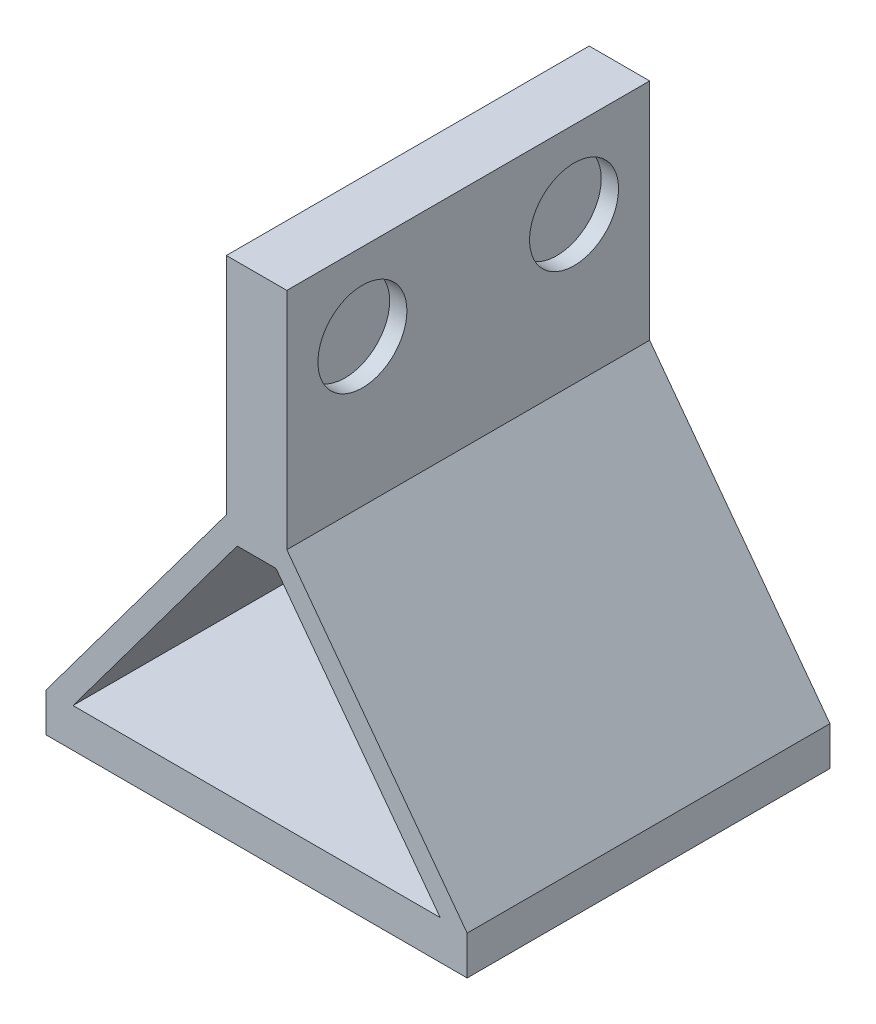
ISO-10303-21;
HEADER;
FILE_DESCRIPTION(('STEP AP214'),'2;1');
FILE_NAME('part.step','',(''),(''),'','','');
FILE_SCHEMA(('AUTOMOTIVE_DESIGN { 1 0 10303 214 1 1 1 1 }'));
ENDSEC;
DATA;
#1=APPLICATION_CONTEXT('core data for automotive mechanical design processes');
#2=APPLICATION_PROTOCOL_DEFINITION('international standard','automotive_design',2000,#1);
#3=PRODUCT_CONTEXT('',#1,'mechanical');
#4=PRODUCT('Part','Part','',(#3));
#5=PRODUCT_RELATED_PRODUCT_CATEGORY('part','',(#4));
#6=PRODUCT_DEFINITION_FORMATION('','',#4);
#7=PRODUCT_DEFINITION_CONTEXT('part definition',#1,'design');
#8=PRODUCT_DEFINITION('design','',#6,#7);
#9=PRODUCT_DEFINITION_SHAPE('','',#8);
#10=(LENGTH_UNIT() NAMED_UNIT(*) SI_UNIT(.MILLI.,.METRE.));
#11=(NAMED_UNIT(*) PLANE_ANGLE_UNIT() SI_UNIT($,.RADIAN.));
#12=(NAMED_UNIT(*) SI_UNIT($,.STERADIAN.) SOLID_ANGLE_UNIT());
#13=UNCERTAINTY_MEASURE_WITH_UNIT(LENGTH_MEASURE(1.E-05),#10,'distance_accuracy_value','');
#14=(GEOMETRIC_REPRESENTATION_CONTEXT(3) GLOBAL_UNCERTAINTY_ASSIGNED_CONTEXT((#13)) GLOBAL_UNIT_ASSIGNED_CONTEXT((#10,
#11,#12)) REPRESENTATION_CONTEXT('',''));
#15=CARTESIAN_POINT('',(0.,0.,0.));
#16=DIRECTION('',(0.,0.,1.));
#17=DIRECTION('',(1.,0.,0.));
#18=AXIS2_PLACEMENT_3D('',#15,#16,#17);
#19=CARTESIAN_POINT('',(0.,0.,42.));
#20=DIRECTION('',(0.,0.,1.));
#21=DIRECTION('',(1.,0.,0.));
#22=AXIS2_PLACEMENT_3D('',#19,#20,#21);
#23=PLANE('',#22);
#24=DIRECTION('',(-0.597706927132629,-0.801714680704844,0.));
#25=VECTOR('',#24,1.);
#26=CARTESIAN_POINT('',(-4.04711838006231,25.5155763239875,42.));
#27=LINE('',#26,#25);
#28=CARTESIAN_POINT('',(-4.04711838006231,25.5155763239875,42.));
#29=VERTEX_POINT('',#28);
#30=CARTESIAN_POINT('',(-24.9221183800623,-2.48442367601246,42.));
#31=VERTEX_POINT('',#30);
#32=EDGE_CURVE('E283',#29,#31,#27,.T.);
#33=ORIENTED_EDGE('',*,*,#32,.T.);
#34=DIRECTION('',(0.,-1.,0.));
#35=VECTOR('',#34,1.);
#36=CARTESIAN_POINT('',(-24.9221183800623,-2.48442367601246,42.));
#37=LINE('',#36,#35);
#38=CARTESIAN_POINT('',(-24.9221183800623,-6.98442367601246,42.));
#39=VERTEX_POINT('',#38);
#40=EDGE_CURVE('E287',#31,#39,#37,.T.);
#41=ORIENTED_EDGE('',*,*,#40,.T.);
#42=DIRECTION('',(1.,0.,0.));
#43=VECTOR('',#42,1.);
#44=CARTESIAN_POINT('',(-24.9221183800623,-6.98442367601246,42.));
#45=LINE('',#44,#43);
#46=CARTESIAN_POINT('',(23.8278816199377,-6.98442367601246,42.));
#47=VERTEX_POINT('',#46);
#48=EDGE_CURVE('E157',#39,#47,#45,.T.);
#49=ORIENTED_EDGE('',*,*,#48,.T.);
#50=DIRECTION('',(0.,1.,0.));
#51=VECTOR('',#50,1.);
#52=CARTESIAN_POINT('',(23.8278816199377,-2.48442367601246,42.));
#53=LINE('',#52,#51);
#54=CARTESIAN_POINT('',(23.8278816199377,-2.48442367601246,42.));
#55=VERTEX_POINT('',#54);
#56=EDGE_CURVE('E291',#47,#55,#53,.T.);
#57=ORIENTED_EDGE('',*,*,#56,.T.);
#58=DIRECTION('',(-0.597706927132629,0.801714680704844,0.));
#59=VECTOR('',#58,1.);
#60=CARTESIAN_POINT('',(2.95288161993769,25.5155763239875,42.));
#61=LINE('',#60,#59);
#62=CARTESIAN_POINT('',(2.95288161993769,25.5155763239875,42.));
#63=VERTEX_POINT('',#62);
#64=EDGE_CURVE('E294',#55,#63,#61,.T.);
#65=ORIENTED_EDGE('',*,*,#64,.T.);
#66=DIRECTION('',(0.,1.,0.));
#67=VECTOR('',#66,1.);
#68=CARTESIAN_POINT('',(2.95288161993769,25.5155763239875,42.));
#69=LINE('',#68,#67);
#70=CARTESIAN_POINT('',(2.95288161993769,51.5155763239875,42.));
#71=VERTEX_POINT('',#70);
#72=EDGE_CURVE('E234',#63,#71,#69,.T.);
#73=ORIENTED_EDGE('',*,*,#72,.T.);
#74=DIRECTION('',(-1.,0.,0.));
#75=VECTOR('',#74,1.);
#76=CARTESIAN_POINT('',(-4.04711838006231,51.5155763239875,42.));
#77=LINE('',#76,#75);
#78=CARTESIAN_POINT('',(-4.04711838006231,51.5155763239875,42.));
#79=VERTEX_POINT('',#78);
#80=EDGE_CURVE('E222',#71,#79,#77,.T.);
#81=ORIENTED_EDGE('',*,*,#80,.T.);
#82=DIRECTION('',(0.,-1.,0.));
#83=VECTOR('',#82,1.);
#84=CARTESIAN_POINT('',(-4.04711838006231,25.5155763239875,42.));
#85=LINE('',#84,#83);
#86=EDGE_CURVE('E205',#79,#29,#85,.T.);
#87=ORIENTED_EDGE('',*,*,#86,.T.);
#88=EDGE_LOOP('',(#33,#41,#49,#57,#65,#73,#81,#87));
#89=FACE_BOUND('',#88,.T.);
#90=DIRECTION('',(-0.597706927132629,0.801714680704844,0.));
#91=VECTOR('',#90,1.);
#92=CARTESIAN_POINT('',(1.6984045517565,23.0155763239875,42.));
#93=LINE('',#92,#91);
#94=CARTESIAN_POINT('',(20.7095652660422,-2.48442367601246,42.));
#95=VERTEX_POINT('',#94);
#96=CARTESIAN_POINT('',(1.6984045517565,23.0155763239875,42.));
#97=VERTEX_POINT('',#96);
#98=EDGE_CURVE('E249',#95,#97,#93,.T.);
#99=ORIENTED_EDGE('',*,*,#98,.F.);
#100=DIRECTION('',(1.,0.,0.));
#101=VECTOR('',#100,1.);
#102=CARTESIAN_POINT('',(-21.8038020261668,-2.48442367601246,42.));
#103=LINE('',#102,#101);
#104=CARTESIAN_POINT('',(-21.8038020261668,-2.48442367601246,42.));
#105=VERTEX_POINT('',#104);
#106=EDGE_CURVE('E246',#105,#95,#103,.T.);
#107=ORIENTED_EDGE('',*,*,#106,.F.);
#108=DIRECTION('',(-0.597706927132629,-0.801714680704844,0.));
#109=VECTOR('',#108,1.);
#110=CARTESIAN_POINT('',(-21.8038020261668,-2.48442367601246,42.));
#111=LINE('',#110,#109);
#112=CARTESIAN_POINT('',(-2.79264131188112,23.0155763239875,42.));
#113=VERTEX_POINT('',#112);
#114=EDGE_CURVE('E256',#113,#105,#111,.T.);
#115=ORIENTED_EDGE('',*,*,#114,.F.);
#116=DIRECTION('',(-1.,0.,0.));
#117=VECTOR('',#116,1.);
#118=CARTESIAN_POINT('',(-2.79264131188112,23.0155763239875,42.));
#119=LINE('',#118,#117);
#120=EDGE_CURVE('E253',#97,#113,#119,.T.);
#121=ORIENTED_EDGE('',*,*,#120,.F.);
#122=EDGE_LOOP('',(#99,#107,#115,#121));
#123=FACE_BOUND('',#122,.T.);
#124=ADVANCED_FACE('F45',(#89,#123),#23,.T.);
#125=CARTESIAN_POINT('',(0.,0.,0.));
#126=DIRECTION('',(0.,0.,1.));
#127=DIRECTION('',(1.,0.,0.));
#128=AXIS2_PLACEMENT_3D('',#125,#126,#127);
#129=PLANE('',#128);
#130=DIRECTION('',(-0.597706927132629,-0.801714680704844,0.));
#131=VECTOR('',#130,1.);
#132=CARTESIAN_POINT('',(-4.04711838006231,25.5155763239875,0.));
#133=LINE('',#132,#131);
#134=CARTESIAN_POINT('',(-4.04711838006231,25.5155763239875,0.));
#135=VERTEX_POINT('',#134);
#136=CARTESIAN_POINT('',(-24.9221183800623,-2.48442367601246,0.));
#137=VERTEX_POINT('',#136);
#138=EDGE_CURVE('E149',#135,#137,#133,.T.);
#139=ORIENTED_EDGE('',*,*,#138,.F.);
#140=DIRECTION('',(0.,-1.,0.));
#141=VECTOR('',#140,1.);
#142=CARTESIAN_POINT('',(-4.04711838006231,25.5155763239875,0.));
#143=LINE('',#142,#141);
#144=CARTESIAN_POINT('',(-4.04711838006231,51.5155763239875,0.));
#145=VERTEX_POINT('',#144);
#146=EDGE_CURVE('E217',#145,#135,#143,.T.);
#147=ORIENTED_EDGE('',*,*,#146,.F.);
#148=DIRECTION('',(-1.,0.,0.));
#149=VECTOR('',#148,1.);
#150=CARTESIAN_POINT('',(-4.04711838006231,51.5155763239875,0.));
#151=LINE('',#150,#149);
#152=CARTESIAN_POINT('',(2.95288161993769,51.5155763239875,0.));
#153=VERTEX_POINT('',#152);
#154=EDGE_CURVE('E226',#153,#145,#151,.T.);
#155=ORIENTED_EDGE('',*,*,#154,.F.);
#156=DIRECTION('',(0.,1.,0.));
#157=VECTOR('',#156,1.);
#158=CARTESIAN_POINT('',(2.95288161993769,25.5155763239875,0.));
#159=LINE('',#158,#157);
#160=CARTESIAN_POINT('',(2.95288161993769,25.5155763239875,0.));
#161=VERTEX_POINT('',#160);
#162=EDGE_CURVE('E221',#161,#153,#159,.T.);
#163=ORIENTED_EDGE('',*,*,#162,.F.);
#164=DIRECTION('',(-0.597706927132629,0.801714680704844,0.));
#165=VECTOR('',#164,1.);
#166=CARTESIAN_POINT('',(2.95288161993769,25.5155763239875,0.));
#167=LINE('',#166,#165);
#168=CARTESIAN_POINT('',(23.8278816199377,-2.48442367601246,0.));
#169=VERTEX_POINT('',#168);
#170=EDGE_CURVE('E288',#169,#161,#167,.T.);
#171=ORIENTED_EDGE('',*,*,#170,.F.);
#172=DIRECTION('',(0.,1.,0.));
#173=VECTOR('',#172,1.);
#174=CARTESIAN_POINT('',(23.8278816199377,-2.48442367601246,0.));
#175=LINE('',#174,#173);
#176=CARTESIAN_POINT('',(23.8278816199377,-6.98442367601246,0.));
#177=VERTEX_POINT('',#176);
#178=EDGE_CURVE('E148',#177,#169,#175,.T.);
#179=ORIENTED_EDGE('',*,*,#178,.F.);
#180=DIRECTION('',(1.,0.,0.));
#181=VECTOR('',#180,1.);
#182=CARTESIAN_POINT('',(-24.9221183800623,-6.98442367601246,0.));
#183=LINE('',#182,#181);
#184=CARTESIAN_POINT('',(-24.9221183800623,-6.98442367601246,0.));
#185=VERTEX_POINT('',#184);
#186=EDGE_CURVE('E155',#185,#177,#183,.T.);
#187=ORIENTED_EDGE('',*,*,#186,.F.);
#188=DIRECTION('',(0.,-1.,0.));
#189=VECTOR('',#188,1.);
#190=CARTESIAN_POINT('',(-24.9221183800623,-2.48442367601246,0.));
#191=LINE('',#190,#189);
#192=EDGE_CURVE('E137',#137,#185,#191,.T.);
#193=ORIENTED_EDGE('',*,*,#192,.F.);
#194=EDGE_LOOP('',(#139,#147,#155,#163,#171,#179,#187,#193));
#195=FACE_BOUND('',#194,.T.);
#196=DIRECTION('',(1.,0.,0.));
#197=VECTOR('',#196,1.);
#198=CARTESIAN_POINT('',(-21.8038020261668,-2.48442367601246,0.));
#199=LINE('',#198,#197);
#200=CARTESIAN_POINT('',(-21.8038020261668,-2.48442367601246,0.));
#201=VERTEX_POINT('',#200);
#202=CARTESIAN_POINT('',(20.7095652660422,-2.48442367601246,0.));
#203=VERTEX_POINT('',#202);
#204=EDGE_CURVE('E70',#201,#203,#199,.T.);
#205=ORIENTED_EDGE('',*,*,#204,.T.);
#206=DIRECTION('',(-0.597706927132629,0.801714680704844,0.));
#207=VECTOR('',#206,1.);
#208=CARTESIAN_POINT('',(1.6984045517565,23.0155763239875,0.));
#209=LINE('',#208,#207);
#210=CARTESIAN_POINT('',(1.6984045517565,23.0155763239875,0.));
#211=VERTEX_POINT('',#210);
#212=EDGE_CURVE('E262',#203,#211,#209,.T.);
#213=ORIENTED_EDGE('',*,*,#212,.T.);
#214=DIRECTION('',(-1.,0.,0.));
#215=VECTOR('',#214,1.);
#216=CARTESIAN_POINT('',(-2.79264131188112,23.0155763239875,0.));
#217=LINE('',#216,#215);
#218=CARTESIAN_POINT('',(-2.79264131188112,23.0155763239875,0.));
#219=VERTEX_POINT('',#218);
#220=EDGE_CURVE('E266',#211,#219,#217,.T.);
#221=ORIENTED_EDGE('',*,*,#220,.T.);
#222=DIRECTION('',(-0.597706927132629,-0.801714680704844,0.));
#223=VECTOR('',#222,1.);
#224=CARTESIAN_POINT('',(-21.8038020261668,-2.48442367601246,0.));
#225=LINE('',#224,#223);
#226=EDGE_CURVE('E250',#219,#201,#225,.T.);
#227=ORIENTED_EDGE('',*,*,#226,.T.);
#228=EDGE_LOOP('',(#205,#213,#221,#227));
#229=FACE_BOUND('',#228,.T.);
#230=ADVANCED_FACE('F161',(#195,#229),#129,.F.);
#231=CARTESIAN_POINT('',(-4.04711838006231,25.5155763239875,42.));
#232=DIRECTION('',(0.801714680704844,-0.597706927132629,0.));
#233=DIRECTION('',(0.597706927132629,0.801714680704844,0.));
#234=AXIS2_PLACEMENT_3D('',#231,#232,#233);
#235=PLANE('',#234);
#236=ORIENTED_EDGE('',*,*,#138,.T.);
#237=DIRECTION('',(0.,0.,-1.));
#238=VECTOR('',#237,1.);
#239=CARTESIAN_POINT('',(-24.9221183800623,-2.48442367601246,42.));
#240=LINE('',#239,#238);
#241=EDGE_CURVE('E11',#31,#137,#240,.T.);
#242=ORIENTED_EDGE('',*,*,#241,.F.);
#243=ORIENTED_EDGE('',*,*,#32,.F.);
#244=DIRECTION('',(0.,0.,-1.));
#245=VECTOR('',#244,1.);
#246=CARTESIAN_POINT('',(-4.04711838006231,25.5155763239875,42.));
#247=LINE('',#246,#245);
#248=EDGE_CURVE('E297',#29,#135,#247,.T.);
#249=ORIENTED_EDGE('',*,*,#248,.T.);
#250=EDGE_LOOP('',(#236,#242,#243,#249));
#251=FACE_BOUND('',#250,.T.);
#252=ADVANCED_FACE('F47',(#251),#235,.F.);
#253=CARTESIAN_POINT('',(-24.9221183800623,-2.48442367601246,42.));
#254=DIRECTION('',(1.,0.,0.));
#255=DIRECTION('',(0.,0.,-1.));
#256=AXIS2_PLACEMENT_3D('',#253,#254,#255);
#257=PLANE('',#256);
#258=ORIENTED_EDGE('',*,*,#192,.T.);
#259=DIRECTION('',(0.,0.,1.));
#260=VECTOR('',#259,1.);
#261=CARTESIAN_POINT('',(-24.9221183800623,-6.98442367601246,0.));
#262=LINE('',#261,#260);
#263=EDGE_CURVE('E140',#185,#39,#262,.T.);
#264=ORIENTED_EDGE('',*,*,#263,.T.);
#265=ORIENTED_EDGE('',*,*,#40,.F.);
#266=ORIENTED_EDGE('',*,*,#241,.T.);
#267=EDGE_LOOP('',(#258,#264,#265,#266));
#268=FACE_BOUND('',#267,.T.);
#269=ADVANCED_FACE('F139',(#268),#257,.F.);
#270=CARTESIAN_POINT('',(23.8278816199377,-2.48442367601246,42.));
#271=DIRECTION('',(-1.,0.,0.));
#272=DIRECTION('',(0.,0.,1.));
#273=AXIS2_PLACEMENT_3D('',#270,#271,#272);
#274=PLANE('',#273);
#275=ORIENTED_EDGE('',*,*,#178,.T.);
#276=DIRECTION('',(0.,0.,-1.));
#277=VECTOR('',#276,1.);
#278=CARTESIAN_POINT('',(23.8278816199377,-2.48442367601246,42.));
#279=LINE('',#278,#277);
#280=EDGE_CURVE('E55',#55,#169,#279,.T.);
#281=ORIENTED_EDGE('',*,*,#280,.F.);
#282=ORIENTED_EDGE('',*,*,#56,.F.);
#283=DIRECTION('',(0.,0.,1.));
#284=VECTOR('',#283,1.);
#285=CARTESIAN_POINT('',(23.8278816199377,-6.98442367601246,0.));
#286=LINE('',#285,#284);
#287=EDGE_CURVE('E159',#177,#47,#286,.T.);
#288=ORIENTED_EDGE('',*,*,#287,.F.);
#289=EDGE_LOOP('',(#275,#281,#282,#288));
#290=FACE_BOUND('',#289,.T.);
#291=ADVANCED_FACE('F340',(#290),#274,.F.);
#292=CARTESIAN_POINT('',(2.95288161993769,25.5155763239875,42.));
#293=DIRECTION('',(-0.801714680704844,-0.597706927132629,0.));
#294=DIRECTION('',(0.597706927132629,-0.801714680704844,0.));
#295=AXIS2_PLACEMENT_3D('',#292,#293,#294);
#296=PLANE('',#295);
#297=ORIENTED_EDGE('',*,*,#170,.T.);
#298=DIRECTION('',(0.,0.,-1.));
#299=VECTOR('',#298,1.);
#300=CARTESIAN_POINT('',(2.95288161993769,25.5155763239875,42.));
#301=LINE('',#300,#299);
#302=EDGE_CURVE('E306',#63,#161,#301,.T.);
#303=ORIENTED_EDGE('',*,*,#302,.F.);
#304=ORIENTED_EDGE('',*,*,#64,.F.);
#305=ORIENTED_EDGE('',*,*,#280,.T.);
#306=EDGE_LOOP('',(#297,#303,#304,#305));
#307=FACE_BOUND('',#306,.T.);
#308=ADVANCED_FACE('F315',(#307),#296,.F.);
#309=CARTESIAN_POINT('',(-21.8038020261668,-2.48442367601246,42.));
#310=DIRECTION('',(0.,1.,0.));
#311=DIRECTION('',(0.,0.,1.));
#312=AXIS2_PLACEMENT_3D('',#309,#310,#311);
#313=PLANE('',#312);
#314=ORIENTED_EDGE('',*,*,#204,.F.);
#315=DIRECTION('',(0.,0.,-1.));
#316=VECTOR('',#315,1.);
#317=CARTESIAN_POINT('',(-21.8038020261668,-2.48442367601246,42.));
#318=LINE('',#317,#316);
#319=EDGE_CURVE('E259',#105,#201,#318,.T.);
#320=ORIENTED_EDGE('',*,*,#319,.F.);
#321=ORIENTED_EDGE('',*,*,#106,.T.);
#322=DIRECTION('',(0.,0.,-1.));
#323=VECTOR('',#322,1.);
#324=CARTESIAN_POINT('',(20.7095652660422,-2.48442367601246,42.));
#325=LINE('',#324,#323);
#326=EDGE_CURVE('E280',#95,#203,#325,.T.);
#327=ORIENTED_EDGE('',*,*,#326,.T.);
#328=EDGE_LOOP('',(#314,#320,#321,#327));
#329=FACE_BOUND('',#328,.T.);
#330=ADVANCED_FACE('F349',(#329),#313,.T.);
#331=CARTESIAN_POINT('',(1.6984045517565,23.0155763239875,42.));
#332=DIRECTION('',(-0.801714680704844,-0.597706927132629,0.));
#333=DIRECTION('',(0.597706927132629,-0.801714680704844,0.));
#334=AXIS2_PLACEMENT_3D('',#331,#332,#333);
#335=PLANE('',#334);
#336=ORIENTED_EDGE('',*,*,#212,.F.);
#337=ORIENTED_EDGE('',*,*,#326,.F.);
#338=ORIENTED_EDGE('',*,*,#98,.T.);
#339=DIRECTION('',(0.,0.,-1.));
#340=VECTOR('',#339,1.);
#341=CARTESIAN_POINT('',(1.6984045517565,23.0155763239875,42.));
#342=LINE('',#341,#340);
#343=EDGE_CURVE('E277',#97,#211,#342,.T.);
#344=ORIENTED_EDGE('',*,*,#343,.T.);
#345=EDGE_LOOP('',(#336,#337,#338,#344));
#346=FACE_BOUND('',#345,.T.);
#347=ADVANCED_FACE('F470',(#346),#335,.T.);
#348=CARTESIAN_POINT('',(-2.79264131188112,23.0155763239875,42.));
#349=DIRECTION('',(0.,-1.,0.));
#350=DIRECTION('',(0.,0.,-1.));
#351=AXIS2_PLACEMENT_3D('',#348,#349,#350);
#352=PLANE('',#351);
#353=ORIENTED_EDGE('',*,*,#220,.F.);
#354=ORIENTED_EDGE('',*,*,#343,.F.);
#355=ORIENTED_EDGE('',*,*,#120,.T.);
#356=DIRECTION('',(0.,0.,-1.));
#357=VECTOR('',#356,1.);
#358=CARTESIAN_POINT('',(-2.79264131188112,23.0155763239875,42.));
#359=LINE('',#358,#357);
#360=EDGE_CURVE('E62',#113,#219,#359,.T.);
#361=ORIENTED_EDGE('',*,*,#360,.T.);
#362=EDGE_LOOP('',(#353,#354,#355,#361));
#363=FACE_BOUND('',#362,.T.);
#364=ADVANCED_FACE('F478',(#363),#352,.T.);
#365=CARTESIAN_POINT('',(-21.8038020261668,-2.48442367601246,42.));
#366=DIRECTION('',(0.801714680704844,-0.597706927132629,0.));
#367=DIRECTION('',(0.597706927132629,0.801714680704844,0.));
#368=AXIS2_PLACEMENT_3D('',#365,#366,#367);
#369=PLANE('',#368);
#370=ORIENTED_EDGE('',*,*,#226,.F.);
#371=ORIENTED_EDGE('',*,*,#360,.F.);
#372=ORIENTED_EDGE('',*,*,#114,.T.);
#373=ORIENTED_EDGE('',*,*,#319,.T.);
#374=EDGE_LOOP('',(#370,#371,#372,#373));
#375=FACE_BOUND('',#374,.T.);
#376=ADVANCED_FACE('F486',(#375),#369,.T.);
#377=CARTESIAN_POINT('',(-4.04711838006231,25.5155763239875,0.));
#378=DIRECTION('',(-1.,0.,0.));
#379=DIRECTION('',(0.,0.,1.));
#380=AXIS2_PLACEMENT_3D('',#377,#378,#379);
#381=PLANE('',#380);
#382=ORIENTED_EDGE('',*,*,#86,.F.);
#383=DIRECTION('',(0.,0.,1.));
#384=VECTOR('',#383,1.);
#385=CARTESIAN_POINT('',(-4.04711838006231,51.5155763239875,0.));
#386=LINE('',#385,#384);
#387=EDGE_CURVE('E241',#145,#79,#386,.T.);
#388=ORIENTED_EDGE('',*,*,#387,.F.);
#389=ORIENTED_EDGE('',*,*,#146,.T.);
#390=ORIENTED_EDGE('',*,*,#248,.F.);
#391=EDGE_LOOP('',(#382,#388,#389,#390));
#392=FACE_BOUND('',#391,.T.);
#393=ADVANCED_FACE('F332',(#392),#381,.T.);
#394=CARTESIAN_POINT('',(-4.04711838006231,51.5155763239875,0.));
#395=DIRECTION('',(0.,1.,0.));
#396=DIRECTION('',(0.,0.,1.));
#397=AXIS2_PLACEMENT_3D('',#394,#395,#396);
#398=PLANE('',#397);
#399=ORIENTED_EDGE('',*,*,#80,.F.);
#400=DIRECTION('',(0.,0.,1.));
#401=VECTOR('',#400,1.);
#402=CARTESIAN_POINT('',(2.95288161993769,51.5155763239875,0.));
#403=LINE('',#402,#401);
#404=EDGE_CURVE('E230',#153,#71,#403,.T.);
#405=ORIENTED_EDGE('',*,*,#404,.F.);
#406=ORIENTED_EDGE('',*,*,#154,.T.);
#407=ORIENTED_EDGE('',*,*,#387,.T.);
#408=EDGE_LOOP('',(#399,#405,#406,#407));
#409=FACE_BOUND('',#408,.T.);
#410=ADVANCED_FACE('F328',(#409),#398,.T.);
#411=CARTESIAN_POINT('',(2.95288161993769,25.5155763239875,0.));
#412=DIRECTION('',(1.,0.,0.));
#413=DIRECTION('',(0.,0.,-1.));
#414=AXIS2_PLACEMENT_3D('',#411,#412,#413);
#415=PLANE('',#414);
#416=CARTESIAN_POINT('',(2.95288161993769,42.5155763239875,33.25));
#417=DIRECTION('',(1.,0.,0.));
#418=DIRECTION('',(0.,0.,-1.));
#419=AXIS2_PLACEMENT_3D('',#416,#417,#418);
#420=CIRCLE('',#419,5.15);
#421=CARTESIAN_POINT('',(2.95288161993769,42.5155763239875,28.1));
#422=VERTEX_POINT('',#421);
#423=EDGE_CURVE('E206',#422,#422,#420,.T.);
#424=ORIENTED_EDGE('',*,*,#423,.F.);
#425=EDGE_LOOP('',(#424));
#426=FACE_BOUND('',#425,.T.);
#427=CARTESIAN_POINT('',(2.95288161993769,42.5155763239875,8.75));
#428=DIRECTION('',(1.,0.,0.));
#429=DIRECTION('',(0.,0.,-1.));
#430=AXIS2_PLACEMENT_3D('',#427,#428,#429);
#431=CIRCLE('',#430,5.15);
#432=CARTESIAN_POINT('',(2.95288161993769,42.5155763239875,3.6));
#433=VERTEX_POINT('',#432);
#434=EDGE_CURVE('E210',#433,#433,#431,.T.);
#435=ORIENTED_EDGE('',*,*,#434,.F.);
#436=EDGE_LOOP('',(#435));
#437=FACE_BOUND('',#436,.T.);
#438=ORIENTED_EDGE('',*,*,#72,.F.);
#439=ORIENTED_EDGE('',*,*,#302,.T.);
#440=ORIENTED_EDGE('',*,*,#162,.T.);
#441=ORIENTED_EDGE('',*,*,#404,.T.);
#442=EDGE_LOOP('',(#438,#439,#440,#441));
#443=FACE_BOUND('',#442,.T.);
#444=ADVANCED_FACE('F323',(#426,#437,#443),#415,.T.);
#445=CARTESIAN_POINT('',(0.952881619937689,42.5155763239875,8.75));
#446=DIRECTION('',(1.,0.,0.));
#447=DIRECTION('',(0.,0.,-1.));
#448=AXIS2_PLACEMENT_3D('',#445,#446,#447);
#449=CYLINDRICAL_SURFACE('',#448,5.15);
#450=CARTESIAN_POINT('',(0.952881619937689,42.5155763239875,8.75));
#451=DIRECTION('',(1.,0.,0.));
#452=DIRECTION('',(0.,0.,-1.));
#453=AXIS2_PLACEMENT_3D('',#450,#451,#452);
#454=CIRCLE('',#453,5.15);
#455=CARTESIAN_POINT('',(0.952881619937689,42.5155763239875,3.6));
#456=VERTEX_POINT('',#455);
#457=EDGE_CURVE('E200',#456,#456,#454,.T.);
#458=ORIENTED_EDGE('',*,*,#457,.F.);
#459=EDGE_LOOP('',(#458));
#460=FACE_BOUND('',#459,.T.);
#461=ORIENTED_EDGE('',*,*,#434,.T.);
#462=EDGE_LOOP('',(#461));
#463=FACE_BOUND('',#462,.T.);
#464=ADVANCED_FACE('F514',(#460,#463),#449,.F.);
#465=CARTESIAN_POINT('',(0.952881619937689,42.5155763239875,8.75));
#466=DIRECTION('',(1.,0.,0.));
#467=DIRECTION('',(0.,0.,-1.));
#468=AXIS2_PLACEMENT_3D('',#465,#466,#467);
#469=PLANE('',#468);
#470=ORIENTED_EDGE('',*,*,#457,.T.);
#471=EDGE_LOOP('',(#470));
#472=FACE_BOUND('',#471,.T.);
#473=ADVANCED_FACE('F523',(#472),#469,.T.);
#474=CARTESIAN_POINT('',(0.952881619937689,42.5155763239875,33.25));
#475=DIRECTION('',(1.,0.,0.));
#476=DIRECTION('',(0.,0.,-1.));
#477=AXIS2_PLACEMENT_3D('',#474,#475,#476);
#478=CYLINDRICAL_SURFACE('',#477,5.15);
#479=CARTESIAN_POINT('',(0.952881619937689,42.5155763239875,33.25));
#480=DIRECTION('',(1.,0.,0.));
#481=DIRECTION('',(0.,0.,-1.));
#482=AXIS2_PLACEMENT_3D('',#479,#480,#481);
#483=CIRCLE('',#482,5.15);
#484=CARTESIAN_POINT('',(0.952881619937689,42.5155763239875,28.1));
#485=VERTEX_POINT('',#484);
#486=EDGE_CURVE('E201',#485,#485,#483,.T.);
#487=ORIENTED_EDGE('',*,*,#486,.F.);
#488=EDGE_LOOP('',(#487));
#489=FACE_BOUND('',#488,.T.);
#490=ORIENTED_EDGE('',*,*,#423,.T.);
#491=EDGE_LOOP('',(#490));
#492=FACE_BOUND('',#491,.T.);
#493=ADVANCED_FACE('F532',(#489,#492),#478,.F.);
#494=CARTESIAN_POINT('',(0.952881619937689,42.5155763239875,33.25));
#495=DIRECTION('',(1.,0.,0.));
#496=DIRECTION('',(0.,0.,-1.));
#497=AXIS2_PLACEMENT_3D('',#494,#495,#496);
#498=PLANE('',#497);
#499=ORIENTED_EDGE('',*,*,#486,.T.);
#500=EDGE_LOOP('',(#499));
#501=FACE_BOUND('',#500,.T.);
#502=ADVANCED_FACE('F366',(#501),#498,.T.);
#503=CARTESIAN_POINT('',(-24.9221183800623,-6.98442367601246,0.));
#504=DIRECTION('',(0.,-1.,0.));
#505=DIRECTION('',(0.,0.,-1.));
#506=AXIS2_PLACEMENT_3D('',#503,#504,#505);
#507=PLANE('',#506);
#508=CARTESIAN_POINT('',(-12.9221183800623,-6.98442367601246,33.4));
#509=DIRECTION('',(0.,-1.,0.));
#510=DIRECTION('',(0.,0.,-1.));
#511=AXIS2_PLACEMENT_3D('',#508,#509,#510);
#512=CIRCLE('',#511,3.25);
#513=CARTESIAN_POINT('',(-12.9221183800623,-6.98442367601246,30.15));
#514=VERTEX_POINT('',#513);
#515=EDGE_CURVE('E180',#514,#514,#512,.T.);
#516=ORIENTED_EDGE('',*,*,#515,.F.);
#517=EDGE_LOOP('',(#516));
#518=FACE_BOUND('',#517,.T.);
#519=CARTESIAN_POINT('',(11.8778816199377,-6.98442367601246,33.4));
#520=DIRECTION('',(0.,-1.,0.));
#521=DIRECTION('',(0.,0.,-1.));
#522=AXIS2_PLACEMENT_3D('',#519,#520,#521);
#523=CIRCLE('',#522,3.25);
#524=CARTESIAN_POINT('',(11.8778816199377,-6.98442367601246,30.15));
#525=VERTEX_POINT('',#524);
#526=EDGE_CURVE('E176',#525,#525,#523,.T.);
#527=ORIENTED_EDGE('',*,*,#526,.F.);
#528=EDGE_LOOP('',(#527));
#529=FACE_BOUND('',#528,.T.);
#530=CARTESIAN_POINT('',(11.8778816199379,-6.98442367601246,8.6));
#531=DIRECTION('',(0.,-1.,0.));
#532=DIRECTION('',(0.,0.,-1.));
#533=AXIS2_PLACEMENT_3D('',#530,#531,#532);
#534=CIRCLE('',#533,3.25);
#535=CARTESIAN_POINT('',(11.8778816199379,-6.98442367601246,5.35));
#536=VERTEX_POINT('',#535);
#537=EDGE_CURVE('E172',#536,#536,#534,.T.);
#538=ORIENTED_EDGE('',*,*,#537,.F.);
#539=EDGE_LOOP('',(#538));
#540=FACE_BOUND('',#539,.T.);
#541=CARTESIAN_POINT('',(-12.9221183800621,-6.98442367601246,8.6));
#542=DIRECTION('',(0.,-1.,0.));
#543=DIRECTION('',(0.,0.,-1.));
#544=AXIS2_PLACEMENT_3D('',#541,#542,#543);
#545=CIRCLE('',#544,3.25);
#546=CARTESIAN_POINT('',(-12.9221183800621,-6.98442367601246,5.35));
#547=VERTEX_POINT('',#546);
#548=EDGE_CURVE('E49',#547,#547,#545,.T.);
#549=ORIENTED_EDGE('',*,*,#548,.F.);
#550=EDGE_LOOP('',(#549));
#551=FACE_BOUND('',#550,.T.);
#552=ORIENTED_EDGE('',*,*,#48,.F.);
#553=ORIENTED_EDGE('',*,*,#263,.F.);
#554=ORIENTED_EDGE('',*,*,#186,.T.);
#555=ORIENTED_EDGE('',*,*,#287,.T.);
#556=EDGE_LOOP('',(#552,#553,#554,#555));
#557=FACE_BOUND('',#556,.T.);
#558=ADVANCED_FACE('F153',(#518,#529,#540,#551,#557),#507,.T.);
#559=CARTESIAN_POINT('',(11.8778816199379,-11.9844236760125,8.6));
#560=DIRECTION('',(0.,-1.,0.));
#561=DIRECTION('',(0.,0.,-1.));
#562=AXIS2_PLACEMENT_3D('',#559,#560,#561);
#563=PLANE('',#562);
#564=CARTESIAN_POINT('',(11.8778816199379,-11.9844236760125,8.6));
#565=DIRECTION('',(0.,-1.,0.));
#566=DIRECTION('',(0.,0.,-1.));
#567=AXIS2_PLACEMENT_3D('',#564,#565,#566);
#568=CIRCLE('',#567,3.25);
#569=CARTESIAN_POINT('',(11.8778816199379,-11.9844236760125,5.35));
#570=VERTEX_POINT('',#569);
#571=EDGE_CURVE('E188',#570,#570,#568,.T.);
#572=ORIENTED_EDGE('',*,*,#571,.T.);
#573=EDGE_LOOP('',(#572));
#574=FACE_BOUND('',#573,.T.);
#575=ADVANCED_FACE('F365',(#574),#563,.T.);
#576=CARTESIAN_POINT('',(11.8778816199379,-11.9844236760125,8.6));
#577=DIRECTION('',(0.,1.,0.));
#578=DIRECTION('',(0.,0.,1.));
#579=AXIS2_PLACEMENT_3D('',#576,#577,#578);
#580=CYLINDRICAL_SURFACE('',#579,3.25);
#581=ORIENTED_EDGE('',*,*,#537,.T.);
#582=EDGE_LOOP('',(#581));
#583=FACE_BOUND('',#582,.T.);
#584=ORIENTED_EDGE('',*,*,#571,.F.);
#585=EDGE_LOOP('',(#584));
#586=FACE_BOUND('',#585,.T.);
#587=ADVANCED_FACE('F372',(#583,#586),#580,.T.);
#588=CARTESIAN_POINT('',(11.8778816199377,-11.9844236760125,33.4));
#589=DIRECTION('',(0.,-1.,0.));
#590=DIRECTION('',(0.,0.,-1.));
#591=AXIS2_PLACEMENT_3D('',#588,#589,#590);
#592=PLANE('',#591);
#593=CARTESIAN_POINT('',(11.8778816199377,-11.9844236760125,33.4));
#594=DIRECTION('',(0.,-1.,0.));
#595=DIRECTION('',(0.,0.,-1.));
#596=AXIS2_PLACEMENT_3D('',#593,#594,#595);
#597=CIRCLE('',#596,3.25);
#598=CARTESIAN_POINT('',(11.8778816199377,-11.9844236760125,30.15));
#599=VERTEX_POINT('',#598);
#600=EDGE_CURVE('E192',#599,#599,#597,.T.);
#601=ORIENTED_EDGE('',*,*,#600,.T.);
#602=EDGE_LOOP('',(#601));
#603=FACE_BOUND('',#602,.T.);
#604=ADVANCED_FACE('F376',(#603),#592,.T.);
#605=CARTESIAN_POINT('',(11.8778816199377,-11.9844236760125,33.4));
#606=DIRECTION('',(0.,1.,0.));
#607=DIRECTION('',(0.,0.,1.));
#608=AXIS2_PLACEMENT_3D('',#605,#606,#607);
#609=CYLINDRICAL_SURFACE('',#608,3.25);
#610=ORIENTED_EDGE('',*,*,#526,.T.);
#611=EDGE_LOOP('',(#610));
#612=FACE_BOUND('',#611,.T.);
#613=ORIENTED_EDGE('',*,*,#600,.F.);
#614=EDGE_LOOP('',(#613));
#615=FACE_BOUND('',#614,.T.);
#616=ADVANCED_FACE('F384',(#612,#615),#609,.T.);
#617=CARTESIAN_POINT('',(-12.9221183800623,-11.9844236760125,33.4));
#618=DIRECTION('',(0.,-1.,0.));
#619=DIRECTION('',(0.,0.,-1.));
#620=AXIS2_PLACEMENT_3D('',#617,#618,#619);
#621=PLANE('',#620);
#622=CARTESIAN_POINT('',(-12.9221183800623,-11.9844236760125,33.4));
#623=DIRECTION('',(0.,-1.,0.));
#624=DIRECTION('',(0.,0.,-1.));
#625=AXIS2_PLACEMENT_3D('',#622,#623,#624);
#626=CIRCLE('',#625,3.25);
#627=CARTESIAN_POINT('',(-12.9221183800623,-11.9844236760125,30.15));
#628=VERTEX_POINT('',#627);
#629=EDGE_CURVE('E196',#628,#628,#626,.T.);
#630=ORIENTED_EDGE('',*,*,#629,.T.);
#631=EDGE_LOOP('',(#630));
#632=FACE_BOUND('',#631,.T.);
#633=ADVANCED_FACE('F388',(#632),#621,.T.);
#634=CARTESIAN_POINT('',(-12.9221183800623,-11.9844236760125,33.4));
#635=DIRECTION('',(0.,1.,0.));
#636=DIRECTION('',(0.,0.,1.));
#637=AXIS2_PLACEMENT_3D('',#634,#635,#636);
#638=CYLINDRICAL_SURFACE('',#637,3.25);
#639=ORIENTED_EDGE('',*,*,#515,.T.);
#640=EDGE_LOOP('',(#639));
#641=FACE_BOUND('',#640,.T.);
#642=ORIENTED_EDGE('',*,*,#629,.F.);
#643=EDGE_LOOP('',(#642));
#644=FACE_BOUND('',#643,.T.);
#645=ADVANCED_FACE('F395',(#641,#644),#638,.T.);
#646=CARTESIAN_POINT('',(-12.9221183800621,-11.9844236760125,8.6));
#647=DIRECTION('',(0.,-1.,0.));
#648=DIRECTION('',(0.,0.,-1.));
#649=AXIS2_PLACEMENT_3D('',#646,#647,#648);
#650=PLANE('',#649);
#651=CARTESIAN_POINT('',(-12.9221183800621,-11.9844236760125,8.6));
#652=DIRECTION('',(0.,-1.,0.));
#653=DIRECTION('',(0.,0.,-1.));
#654=AXIS2_PLACEMENT_3D('',#651,#652,#653);
#655=CIRCLE('',#654,3.25);
#656=CARTESIAN_POINT('',(-12.9221183800621,-11.9844236760125,5.35));
#657=VERTEX_POINT('',#656);
#658=EDGE_CURVE('E184',#657,#657,#655,.T.);
#659=ORIENTED_EDGE('',*,*,#658,.T.);
#660=EDGE_LOOP('',(#659));
#661=FACE_BOUND('',#660,.T.);
#662=ADVANCED_FACE('F399',(#661),#650,.T.);
#663=CARTESIAN_POINT('',(-12.9221183800621,-11.9844236760125,8.6));
#664=DIRECTION('',(0.,1.,0.));
#665=DIRECTION('',(0.,0.,1.));
#666=AXIS2_PLACEMENT_3D('',#663,#664,#665);
#667=CYLINDRICAL_SURFACE('',#666,3.25);
#668=ORIENTED_EDGE('',*,*,#548,.T.);
#669=EDGE_LOOP('',(#668));
#670=FACE_BOUND('',#669,.T.);
#671=ORIENTED_EDGE('',*,*,#658,.F.);
#672=EDGE_LOOP('',(#671));
#673=FACE_BOUND('',#672,.T.);
#674=ADVANCED_FACE('F406',(#670,#673),#667,.T.);
#675=CLOSED_SHELL('',(#124,#230,#252,#269,#291,#308,#330,#347,#364,#376,#393,#410,#444,#464,
#473,#493,#502,#558,#575,#587,#604,#616,#633,#645,#662,#674));
#676=MANIFOLD_SOLID_BREP('B2',#675);
#677=ADVANCED_BREP_SHAPE_REPRESENTATION('',(#18,#676),#14);
#678=SHAPE_DEFINITION_REPRESENTATION(#9,#677);
ENDSEC;
END-ISO-10303-21;
